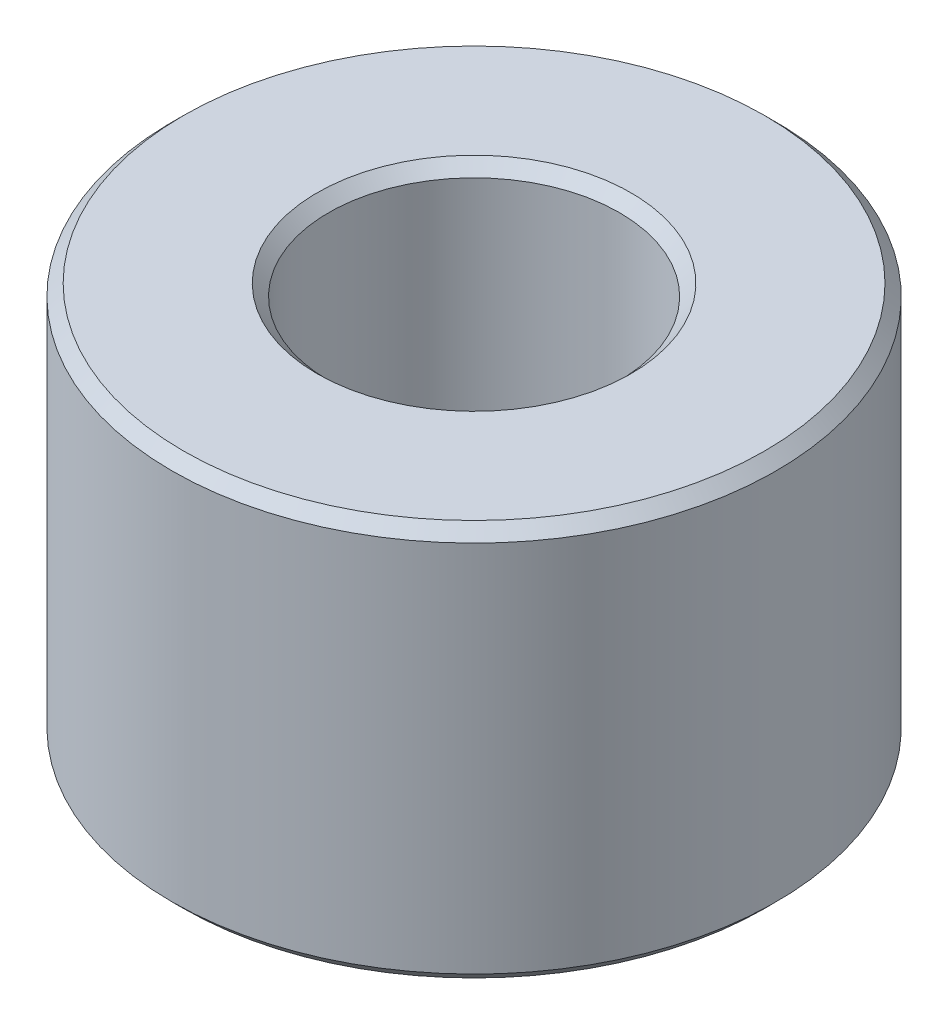
ISO-10303-21;
HEADER;
FILE_DESCRIPTION(('STEP AP214'),'2;1');
FILE_NAME('part.step','',(''),(''),'','','');
FILE_SCHEMA(('AUTOMOTIVE_DESIGN { 1 0 10303 214 1 1 1 1 }'));
ENDSEC;
DATA;
#1=APPLICATION_CONTEXT('core data for automotive mechanical design processes');
#2=APPLICATION_PROTOCOL_DEFINITION('international standard','automotive_design',2000,#1);
#3=PRODUCT_CONTEXT('',#1,'mechanical');
#4=PRODUCT('Part','Part','',(#3));
#5=PRODUCT_RELATED_PRODUCT_CATEGORY('part','',(#4));
#6=PRODUCT_DEFINITION_FORMATION('','',#4);
#7=PRODUCT_DEFINITION_CONTEXT('part definition',#1,'design');
#8=PRODUCT_DEFINITION('design','',#6,#7);
#9=PRODUCT_DEFINITION_SHAPE('','',#8);
#10=(LENGTH_UNIT() NAMED_UNIT(*) SI_UNIT(.MILLI.,.METRE.));
#11=(NAMED_UNIT(*) PLANE_ANGLE_UNIT() SI_UNIT($,.RADIAN.));
#12=(NAMED_UNIT(*) SI_UNIT($,.STERADIAN.) SOLID_ANGLE_UNIT());
#13=UNCERTAINTY_MEASURE_WITH_UNIT(LENGTH_MEASURE(1.E-05),#10,'distance_accuracy_value','');
#14=(GEOMETRIC_REPRESENTATION_CONTEXT(3) GLOBAL_UNCERTAINTY_ASSIGNED_CONTEXT((#13)) GLOBAL_UNIT_ASSIGNED_CONTEXT((#10,
#11,#12)) REPRESENTATION_CONTEXT('',''));
#15=CARTESIAN_POINT('',(0.,0.,0.));
#16=DIRECTION('',(0.,0.,1.));
#17=DIRECTION('',(1.,0.,0.));
#18=AXIS2_PLACEMENT_3D('',#15,#16,#17);
#19=CARTESIAN_POINT('',(0.,36.0705288512802,0.));
#20=DIRECTION('',(0.,-1.,0.));
#21=DIRECTION('',(0.,0.,-1.));
#22=AXIS2_PLACEMENT_3D('',#19,#20,#21);
#23=CYLINDRICAL_SURFACE('',#22,27.5);
#24=CARTESIAN_POINT('',(0.,1.04524058927867,0.));
#25=DIRECTION('',(0.,1.,0.));
#26=DIRECTION('',(0.,0.,1.));
#27=AXIS2_PLACEMENT_3D('',#24,#25,#26);
#28=CIRCLE('',#27,27.5);
#29=CARTESIAN_POINT('',(0.,1.04524058927867,27.5));
#30=VERTEX_POINT('',#29);
#31=EDGE_CURVE('E10',#30,#30,#28,.T.);
#32=ORIENTED_EDGE('',*,*,#31,.T.);
#33=EDGE_LOOP('',(#32));
#34=FACE_BOUND('',#33,.T.);
#35=CARTESIAN_POINT('',(0.,35.0252882620015,0.));
#36=DIRECTION('',(0.,1.,0.));
#37=DIRECTION('',(0.,0.,1.));
#38=AXIS2_PLACEMENT_3D('',#35,#36,#37);
#39=CIRCLE('',#38,27.5);
#40=CARTESIAN_POINT('',(0.,35.0252882620015,27.5));
#41=VERTEX_POINT('',#40);
#42=EDGE_CURVE('E50',#41,#41,#39,.F.);
#43=ORIENTED_EDGE('',*,*,#42,.T.);
#44=EDGE_LOOP('',(#43));
#45=FACE_BOUND('',#44,.T.);
#46=ADVANCED_FACE('F39',(#34,#45),#23,.T.);
#47=CARTESIAN_POINT('',(0.,36.0705288512802,0.));
#48=DIRECTION('',(0.,1.,0.));
#49=DIRECTION('',(0.,0.,1.));
#50=AXIS2_PLACEMENT_3D('',#47,#48,#49);
#51=PLANE('',#50);
#52=CARTESIAN_POINT('',(0.,36.0705288512802,0.));
#53=DIRECTION('',(0.,1.,0.));
#54=DIRECTION('',(0.,0.,1.));
#55=AXIS2_PLACEMENT_3D('',#52,#53,#54);
#56=CIRCLE('',#55,14.2813479672773);
#57=CARTESIAN_POINT('',(0.,36.0705288512802,14.2813479672773));
#58=VERTEX_POINT('',#57);
#59=EDGE_CURVE('E58',#58,#58,#56,.F.);
#60=ORIENTED_EDGE('',*,*,#59,.T.);
#61=EDGE_LOOP('',(#60));
#62=FACE_BOUND('',#61,.T.);
#63=CARTESIAN_POINT('',(0.,36.0705288512802,0.));
#64=DIRECTION('',(0.,1.,0.));
#65=DIRECTION('',(0.,0.,1.));
#66=AXIS2_PLACEMENT_3D('',#63,#64,#65);
#67=CIRCLE('',#66,26.4547594107213);
#68=CARTESIAN_POINT('',(0.,36.0705288512802,26.4547594107213));
#69=VERTEX_POINT('',#68);
#70=EDGE_CURVE('E61',#69,#69,#67,.T.);
#71=ORIENTED_EDGE('',*,*,#70,.T.);
#72=EDGE_LOOP('',(#71));
#73=FACE_BOUND('',#72,.T.);
#74=ADVANCED_FACE('F88',(#62,#73),#51,.T.);
#75=CARTESIAN_POINT('',(0.,0.,0.));
#76=DIRECTION('',(0.,1.,0.));
#77=DIRECTION('',(0.,0.,1.));
#78=AXIS2_PLACEMENT_3D('',#75,#76,#77);
#79=PLANE('',#78);
#80=CARTESIAN_POINT('',(0.,0.,0.));
#81=DIRECTION('',(0.,1.,0.));
#82=DIRECTION('',(0.,0.,1.));
#83=AXIS2_PLACEMENT_3D('',#80,#81,#82);
#84=CIRCLE('',#83,14.2813479672773);
#85=CARTESIAN_POINT('',(0.,0.,14.2813479672773));
#86=VERTEX_POINT('',#85);
#87=EDGE_CURVE('E51',#86,#86,#84,.T.);
#88=ORIENTED_EDGE('',*,*,#87,.T.);
#89=EDGE_LOOP('',(#88));
#90=FACE_BOUND('',#89,.T.);
#91=CARTESIAN_POINT('',(0.,0.,0.));
#92=DIRECTION('',(0.,1.,0.));
#93=DIRECTION('',(0.,0.,1.));
#94=AXIS2_PLACEMENT_3D('',#91,#92,#93);
#95=CIRCLE('',#94,26.4547594107213);
#96=CARTESIAN_POINT('',(0.,0.,26.4547594107213));
#97=VERTEX_POINT('',#96);
#98=EDGE_CURVE('E54',#97,#97,#95,.F.);
#99=ORIENTED_EDGE('',*,*,#98,.T.);
#100=EDGE_LOOP('',(#99));
#101=FACE_BOUND('',#100,.T.);
#102=ADVANCED_FACE('F83',(#90,#101),#79,.F.);
#103=CARTESIAN_POINT('',(0.,36.0705288512802,0.));
#104=DIRECTION('',(0.,-1.,0.));
#105=DIRECTION('',(0.,0.,-1.));
#106=AXIS2_PLACEMENT_3D('',#103,#104,#105);
#107=CYLINDRICAL_SURFACE('',#106,13.2361073779986);
#108=CARTESIAN_POINT('',(0.,35.0252882620016,0.));
#109=DIRECTION('',(0.,1.,0.));
#110=DIRECTION('',(0.,0.,1.));
#111=AXIS2_PLACEMENT_3D('',#108,#109,#110);
#112=CIRCLE('',#111,13.2361073779986);
#113=CARTESIAN_POINT('',(0.,35.0252882620016,13.2361073779986));
#114=VERTEX_POINT('',#113);
#115=EDGE_CURVE('E67',#114,#114,#112,.T.);
#116=ORIENTED_EDGE('',*,*,#115,.T.);
#117=EDGE_LOOP('',(#116));
#118=FACE_BOUND('',#117,.T.);
#119=CARTESIAN_POINT('',(0.,1.04524058927869,0.));
#120=DIRECTION('',(0.,1.,0.));
#121=DIRECTION('',(0.,0.,1.));
#122=AXIS2_PLACEMENT_3D('',#119,#120,#121);
#123=CIRCLE('',#122,13.2361073779986);
#124=CARTESIAN_POINT('',(0.,1.04524058927869,13.2361073779986));
#125=VERTEX_POINT('',#124);
#126=EDGE_CURVE('E69',#125,#125,#123,.F.);
#127=ORIENTED_EDGE('',*,*,#126,.T.);
#128=EDGE_LOOP('',(#127));
#129=FACE_BOUND('',#128,.T.);
#130=ADVANCED_FACE('F71',(#118,#129),#107,.F.);
#131=CARTESIAN_POINT('',(0.,35.0252882620016,0.));
#132=DIRECTION('',(0.,1.,0.));
#133=DIRECTION('',(0.,0.,1.));
#134=AXIS2_PLACEMENT_3D('',#131,#132,#133);
#135=CONICAL_SURFACE('',#134,13.2361073779986,0.785398163397454);
#136=ORIENTED_EDGE('',*,*,#59,.F.);
#137=EDGE_LOOP('',(#136));
#138=FACE_BOUND('',#137,.T.);
#139=ORIENTED_EDGE('',*,*,#115,.F.);
#140=EDGE_LOOP('',(#139));
#141=FACE_BOUND('',#140,.T.);
#142=ADVANCED_FACE('F77',(#138,#141),#135,.F.);
#143=CARTESIAN_POINT('',(0.,0.,0.));
#144=DIRECTION('',(0.,-1.,0.));
#145=DIRECTION('',(0.,0.,-1.));
#146=AXIS2_PLACEMENT_3D('',#143,#144,#145);
#147=CONICAL_SURFACE('',#146,14.2813479672773,0.785398163397445);
#148=ORIENTED_EDGE('',*,*,#126,.F.);
#149=EDGE_LOOP('',(#148));
#150=FACE_BOUND('',#149,.T.);
#151=ORIENTED_EDGE('',*,*,#87,.F.);
#152=EDGE_LOOP('',(#151));
#153=FACE_BOUND('',#152,.T.);
#154=ADVANCED_FACE('F73',(#150,#153),#147,.F.);
#155=CARTESIAN_POINT('',(0.,1.04524058927867,0.));
#156=DIRECTION('',(0.,1.,0.));
#157=DIRECTION('',(0.,0.,1.));
#158=AXIS2_PLACEMENT_3D('',#155,#156,#157);
#159=CONICAL_SURFACE('',#158,27.5,0.785398163397453);
#160=ORIENTED_EDGE('',*,*,#98,.F.);
#161=EDGE_LOOP('',(#160));
#162=FACE_BOUND('',#161,.T.);
#163=ORIENTED_EDGE('',*,*,#31,.F.);
#164=EDGE_LOOP('',(#163));
#165=FACE_BOUND('',#164,.T.);
#166=ADVANCED_FACE('F76',(#162,#165),#159,.T.);
#167=CARTESIAN_POINT('',(0.,36.0705288512802,0.));
#168=DIRECTION('',(0.,-1.,0.));
#169=DIRECTION('',(0.,0.,-1.));
#170=AXIS2_PLACEMENT_3D('',#167,#168,#169);
#171=CONICAL_SURFACE('',#170,26.4547594107213,0.785398163397447);
#172=ORIENTED_EDGE('',*,*,#42,.F.);
#173=EDGE_LOOP('',(#172));
#174=FACE_BOUND('',#173,.T.);
#175=ORIENTED_EDGE('',*,*,#70,.F.);
#176=EDGE_LOOP('',(#175));
#177=FACE_BOUND('',#176,.T.);
#178=ADVANCED_FACE('F45',(#174,#177),#171,.T.);
#179=CLOSED_SHELL('',(#46,#74,#102,#130,#142,#154,#166,#178));
#180=MANIFOLD_SOLID_BREP('B2',#179);
#181=ADVANCED_BREP_SHAPE_REPRESENTATION('',(#18,#180),#14);
#182=SHAPE_DEFINITION_REPRESENTATION(#9,#181);
ENDSEC;
END-ISO-10303-21;
